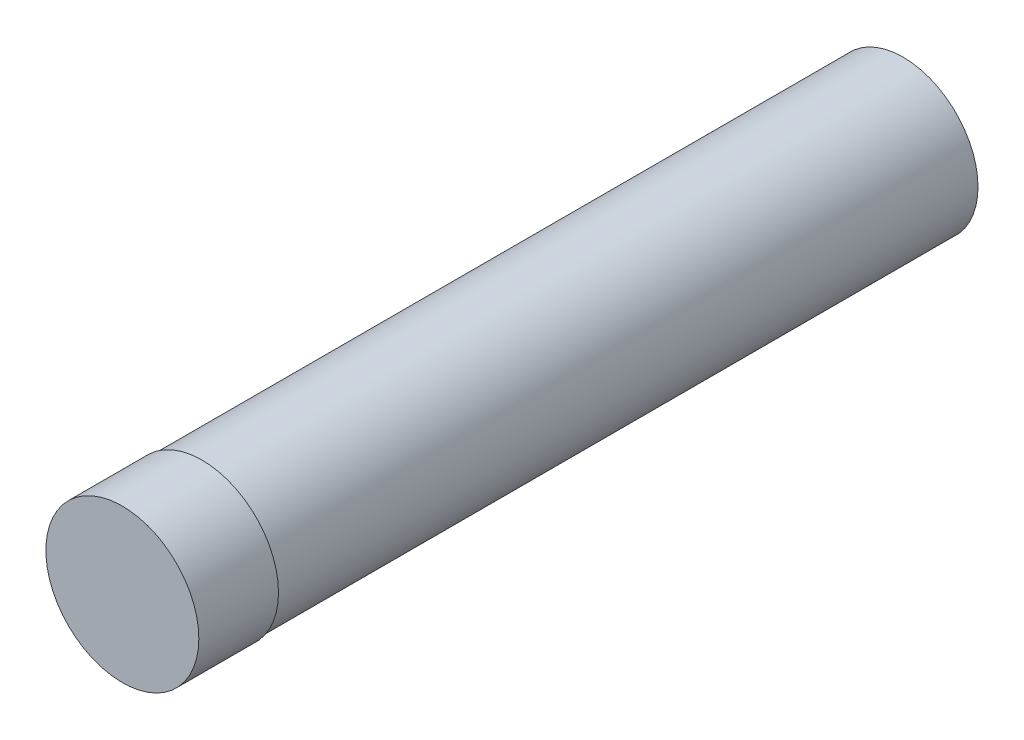
ISO-10303-21;
HEADER;
FILE_DESCRIPTION(('STEP AP214'),'2;1');
FILE_NAME('part.step','',(''),(''),'','','');
FILE_SCHEMA(('AUTOMOTIVE_DESIGN { 1 0 10303 214 1 1 1 1 }'));
ENDSEC;
DATA;
#1=APPLICATION_CONTEXT('core data for automotive mechanical design processes');
#2=APPLICATION_PROTOCOL_DEFINITION('international standard','automotive_design',2000,#1);
#3=PRODUCT_CONTEXT('',#1,'mechanical');
#4=PRODUCT('Part','Part','',(#3));
#5=PRODUCT_RELATED_PRODUCT_CATEGORY('part','',(#4));
#6=PRODUCT_DEFINITION_FORMATION('','',#4);
#7=PRODUCT_DEFINITION_CONTEXT('part definition',#1,'design');
#8=PRODUCT_DEFINITION('design','',#6,#7);
#9=PRODUCT_DEFINITION_SHAPE('','',#8);
#10=(LENGTH_UNIT() NAMED_UNIT(*) SI_UNIT(.MILLI.,.METRE.));
#11=(NAMED_UNIT(*) PLANE_ANGLE_UNIT() SI_UNIT($,.RADIAN.));
#12=(NAMED_UNIT(*) SI_UNIT($,.STERADIAN.) SOLID_ANGLE_UNIT());
#13=UNCERTAINTY_MEASURE_WITH_UNIT(LENGTH_MEASURE(1.E-05),#10,'distance_accuracy_value','');
#14=(GEOMETRIC_REPRESENTATION_CONTEXT(3) GLOBAL_UNCERTAINTY_ASSIGNED_CONTEXT((#13)) GLOBAL_UNIT_ASSIGNED_CONTEXT((#10,
#11,#12)) REPRESENTATION_CONTEXT('',''));
#15=CARTESIAN_POINT('',(0.,0.,0.));
#16=DIRECTION('',(0.,0.,1.));
#17=DIRECTION('',(1.,0.,0.));
#18=AXIS2_PLACEMENT_3D('',#15,#16,#17);
#19=CARTESIAN_POINT('',(0.,0.,5.));
#20=DIRECTION('',(0.,0.,-1.));
#21=DIRECTION('',(-1.,0.,0.));
#22=AXIS2_PLACEMENT_3D('',#19,#20,#21);
#23=CYLINDRICAL_SURFACE('',#22,4.8);
#24=CARTESIAN_POINT('',(0.,0.,5.));
#25=DIRECTION('',(0.,0.,1.));
#26=DIRECTION('',(1.,0.,0.));
#27=AXIS2_PLACEMENT_3D('',#24,#25,#26);
#28=CIRCLE('',#27,4.8);
#29=CARTESIAN_POINT('',(4.8,0.,5.));
#30=VERTEX_POINT('',#29);
#31=EDGE_CURVE('E50',#30,#30,#28,.T.);
#32=ORIENTED_EDGE('',*,*,#31,.F.);
#33=EDGE_LOOP('',(#32));
#34=FACE_BOUND('',#33,.T.);
#35=CARTESIAN_POINT('',(0.,0.,0.));
#36=DIRECTION('',(0.,0.,1.));
#37=DIRECTION('',(1.,0.,0.));
#38=AXIS2_PLACEMENT_3D('',#35,#36,#37);
#39=CIRCLE('',#38,4.8);
#40=CARTESIAN_POINT('',(4.8,0.,0.));
#41=VERTEX_POINT('',#40);
#42=EDGE_CURVE('E55',#41,#41,#39,.T.);
#43=ORIENTED_EDGE('',*,*,#42,.T.);
#44=EDGE_LOOP('',(#43));
#45=FACE_BOUND('',#44,.T.);
#46=ADVANCED_FACE('F43',(#34,#45),#23,.T.);
#47=CARTESIAN_POINT('',(0.,0.,5.));
#48=DIRECTION('',(0.,0.,1.));
#49=DIRECTION('',(1.,0.,0.));
#50=AXIS2_PLACEMENT_3D('',#47,#48,#49);
#51=PLANE('',#50);
#52=ORIENTED_EDGE('',*,*,#31,.T.);
#53=EDGE_LOOP('',(#52));
#54=FACE_BOUND('',#53,.T.);
#55=ADVANCED_FACE('F90',(#54),#51,.T.);
#56=CARTESIAN_POINT('',(0.,0.,0.));
#57=DIRECTION('',(0.,0.,1.));
#58=DIRECTION('',(1.,0.,0.));
#59=AXIS2_PLACEMENT_3D('',#56,#57,#58);
#60=PLANE('',#59);
#61=CARTESIAN_POINT('',(0.,0.,0.));
#62=DIRECTION('',(0.,0.,1.));
#63=DIRECTION('',(1.,0.,0.));
#64=AXIS2_PLACEMENT_3D('',#61,#62,#63);
#65=CIRCLE('',#64,4.7);
#66=CARTESIAN_POINT('',(4.7,0.,0.));
#67=VERTEX_POINT('',#66);
#68=EDGE_CURVE('E11',#67,#67,#65,.F.);
#69=ORIENTED_EDGE('',*,*,#68,.F.);
#70=EDGE_LOOP('',(#69));
#71=FACE_BOUND('',#70,.T.);
#72=ORIENTED_EDGE('',*,*,#42,.F.);
#73=EDGE_LOOP('',(#72));
#74=FACE_BOUND('',#73,.T.);
#75=ADVANCED_FACE('F81',(#71,#74),#60,.F.);
#76=CARTESIAN_POINT('',(0.,0.,-44.));
#77=DIRECTION('',(0.,0.,-1.));
#78=DIRECTION('',(-1.,0.,0.));
#79=AXIS2_PLACEMENT_3D('',#76,#77,#78);
#80=PLANE('',#79);
#81=CARTESIAN_POINT('',(0.,0.,-44.));
#82=DIRECTION('',(0.,0.,-1.));
#83=DIRECTION('',(-1.,0.,0.));
#84=AXIS2_PLACEMENT_3D('',#81,#82,#83);
#85=CIRCLE('',#84,4.7);
#86=CARTESIAN_POINT('',(-4.7,0.,-44.));
#87=VERTEX_POINT('',#86);
#88=EDGE_CURVE('E61',#87,#87,#85,.T.);
#89=ORIENTED_EDGE('',*,*,#88,.T.);
#90=EDGE_LOOP('',(#89));
#91=FACE_BOUND('',#90,.T.);
#92=CARTESIAN_POINT('',(0.,0.,-44.));
#93=DIRECTION('',(0.,0.,-1.));
#94=DIRECTION('',(-1.,0.,0.));
#95=AXIS2_PLACEMENT_3D('',#92,#93,#94);
#96=CIRCLE('',#95,3.7);
#97=CARTESIAN_POINT('',(-3.7,0.,-44.));
#98=VERTEX_POINT('',#97);
#99=EDGE_CURVE('E66',#98,#98,#96,.T.);
#100=ORIENTED_EDGE('',*,*,#99,.F.);
#101=EDGE_LOOP('',(#100));
#102=FACE_BOUND('',#101,.T.);
#103=ADVANCED_FACE('F78',(#91,#102),#80,.T.);
#104=CARTESIAN_POINT('',(0.,0.,-44.));
#105=DIRECTION('',(0.,0.,1.));
#106=DIRECTION('',(1.,0.,0.));
#107=AXIS2_PLACEMENT_3D('',#104,#105,#106);
#108=CYLINDRICAL_SURFACE('',#107,4.7);
#109=ORIENTED_EDGE('',*,*,#88,.F.);
#110=EDGE_LOOP('',(#109));
#111=FACE_BOUND('',#110,.T.);
#112=ORIENTED_EDGE('',*,*,#68,.T.);
#113=EDGE_LOOP('',(#112));
#114=FACE_BOUND('',#113,.T.);
#115=ADVANCED_FACE('F80',(#111,#114),#108,.T.);
#116=CARTESIAN_POINT('',(0.,0.,-44.));
#117=DIRECTION('',(0.,0.,1.));
#118=DIRECTION('',(1.,0.,0.));
#119=AXIS2_PLACEMENT_3D('',#116,#117,#118);
#120=CYLINDRICAL_SURFACE('',#119,3.7);
#121=ORIENTED_EDGE('',*,*,#99,.T.);
#122=EDGE_LOOP('',(#121));
#123=FACE_BOUND('',#122,.T.);
#124=CARTESIAN_POINT('',(0.,0.,0.));
#125=DIRECTION('',(0.,0.,-1.));
#126=DIRECTION('',(-1.,0.,0.));
#127=AXIS2_PLACEMENT_3D('',#124,#125,#126);
#128=CIRCLE('',#127,3.7);
#129=CARTESIAN_POINT('',(-3.7,0.,0.));
#130=VERTEX_POINT('',#129);
#131=EDGE_CURVE('E67',#130,#130,#128,.T.);
#132=ORIENTED_EDGE('',*,*,#131,.F.);
#133=EDGE_LOOP('',(#132));
#134=FACE_BOUND('',#133,.T.);
#135=ADVANCED_FACE('F75',(#123,#134),#120,.F.);
#136=ORIENTED_EDGE('',*,*,#131,.T.);
#137=EDGE_LOOP('',(#136));
#138=FACE_BOUND('',#137,.T.);
#139=ADVANCED_FACE('F92',(#138),#60,.F.);
#140=CLOSED_SHELL('',(#46,#55,#75,#103,#115,#135,#139));
#141=MANIFOLD_SOLID_BREP('B2',#140);
#142=ADVANCED_BREP_SHAPE_REPRESENTATION('',(#18,#141),#14);
#143=SHAPE_DEFINITION_REPRESENTATION(#9,#142);
ENDSEC;
END-ISO-10303-21;
